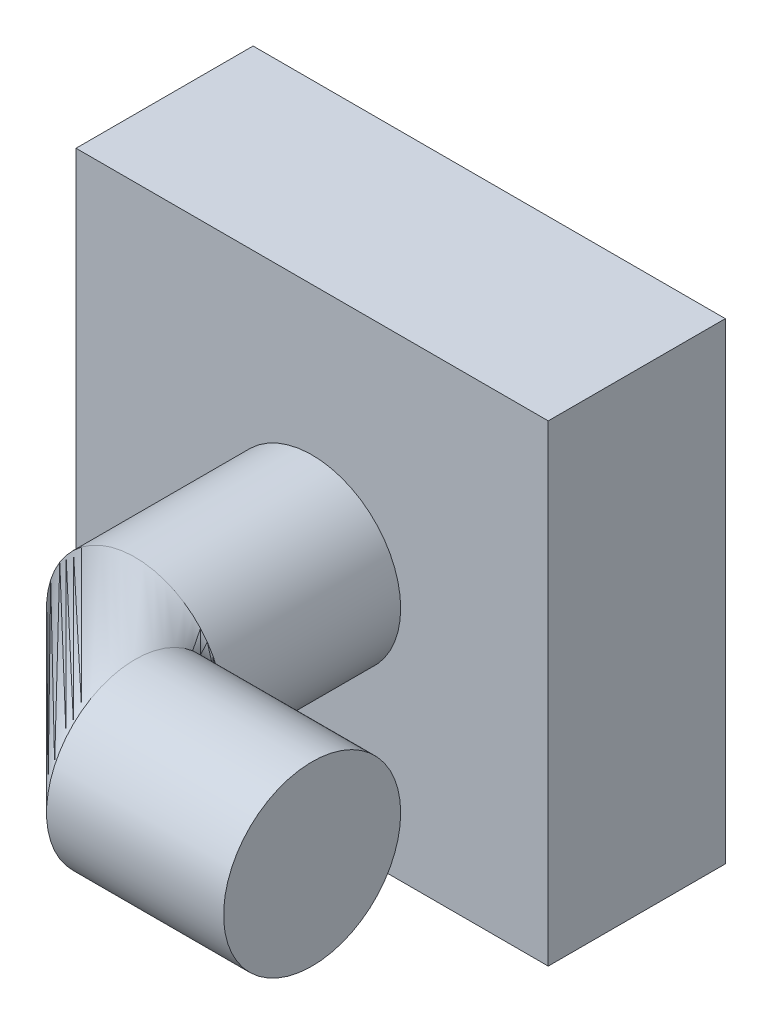
ISO-10303-21;
HEADER;
FILE_DESCRIPTION(('STEP AP214'),'2;1');
FILE_NAME('part.step','',(''),(''),'','','');
FILE_SCHEMA(('AUTOMOTIVE_DESIGN { 1 0 10303 214 1 1 1 1 }'));
ENDSEC;
DATA;
#1=APPLICATION_CONTEXT('core data for automotive mechanical design processes');
#2=APPLICATION_PROTOCOL_DEFINITION('international standard','automotive_design',2000,#1);
#3=PRODUCT_CONTEXT('',#1,'mechanical');
#4=PRODUCT('Part','Part','',(#3));
#5=PRODUCT_RELATED_PRODUCT_CATEGORY('part','',(#4));
#6=PRODUCT_DEFINITION_FORMATION('','',#4);
#7=PRODUCT_DEFINITION_CONTEXT('part definition',#1,'design');
#8=PRODUCT_DEFINITION('design','',#6,#7);
#9=PRODUCT_DEFINITION_SHAPE('','',#8);
#10=(LENGTH_UNIT() NAMED_UNIT(*) SI_UNIT(.MILLI.,.METRE.));
#11=(NAMED_UNIT(*) PLANE_ANGLE_UNIT() SI_UNIT($,.RADIAN.));
#12=(NAMED_UNIT(*) SI_UNIT($,.STERADIAN.) SOLID_ANGLE_UNIT());
#13=UNCERTAINTY_MEASURE_WITH_UNIT(LENGTH_MEASURE(1.E-05),#10,'distance_accuracy_value','');
#14=(GEOMETRIC_REPRESENTATION_CONTEXT(3) GLOBAL_UNCERTAINTY_ASSIGNED_CONTEXT((#13)) GLOBAL_UNIT_ASSIGNED_CONTEXT((#10,
#11,#12)) REPRESENTATION_CONTEXT('',''));
#15=CARTESIAN_POINT('',(0.,0.,0.));
#16=DIRECTION('',(0.,0.,1.));
#17=DIRECTION('',(1.,0.,0.));
#18=AXIS2_PLACEMENT_3D('',#15,#16,#17);
#19=CARTESIAN_POINT('',(57.15,0.,0.));
#20=DIRECTION('',(1.,0.,0.));
#21=DIRECTION('',(0.,0.,-1.));
#22=AXIS2_PLACEMENT_3D('',#19,#20,#21);
#23=PLANE('',#22);
#24=CARTESIAN_POINT('',(57.15,0.,0.));
#25=DIRECTION('',(1.,0.,0.));
#26=DIRECTION('',(0.,0.,-1.));
#27=AXIS2_PLACEMENT_3D('',#24,#25,#26);
#28=CIRCLE('',#27,19.05);
#29=CARTESIAN_POINT('',(57.15,0.,-19.05));
#30=VERTEX_POINT('',#29);
#31=EDGE_CURVE('E133',#30,#30,#28,.T.);
#32=ORIENTED_EDGE('',*,*,#31,.T.);
#33=EDGE_LOOP('',(#32));
#34=FACE_BOUND('',#33,.T.);
#35=ADVANCED_FACE('F39',(#34),#23,.T.);
#36=CARTESIAN_POINT('',(57.15,0.,0.));
#37=DIRECTION('',(-1.,0.,0.));
#38=DIRECTION('',(0.,0.,1.));
#39=AXIS2_PLACEMENT_3D('',#36,#37,#38);
#40=CYLINDRICAL_SURFACE('',#39,19.05);
#41=CARTESIAN_POINT('',(19.05,0.,0.));
#42=DIRECTION('',(1.,0.,0.));
#43=DIRECTION('',(0.,0.,-1.));
#44=AXIS2_PLACEMENT_3D('',#41,#42,#43);
#45=CIRCLE('',#44,19.05);
#46=CARTESIAN_POINT('',(19.05,0.,-19.05));
#47=VERTEX_POINT('',#46);
#48=EDGE_CURVE('E48',#47,#47,#45,.T.);
#49=ORIENTED_EDGE('',*,*,#48,.T.);
#50=EDGE_LOOP('',(#49));
#51=FACE_BOUND('',#50,.T.);
#52=ORIENTED_EDGE('',*,*,#31,.F.);
#53=EDGE_LOOP('',(#52));
#54=FACE_BOUND('',#53,.T.);
#55=ADVANCED_FACE('F139',(#51,#54),#40,.T.);
#56=CARTESIAN_POINT('',(19.05,0.,-19.05));
#57=DIRECTION('',(0.,-1.,0.));
#58=DIRECTION('',(0.,0.,-1.));
#59=AXIS2_PLACEMENT_3D('',#56,#57,#58);
#60=TOROIDAL_SURFACE('',#59,19.05,19.05);
#61=CARTESIAN_POINT('',(0.,0.,-19.05));
#62=DIRECTION('',(0.,0.,1.));
#63=DIRECTION('',(1.,0.,0.));
#64=AXIS2_PLACEMENT_3D('',#61,#62,#63);
#65=CIRCLE('',#64,19.05);
#66=EDGE_CURVE('E11',#47,#47,#65,.T.);
#67=ORIENTED_EDGE('',*,*,#66,.T.);
#68=ORIENTED_EDGE('',*,*,#48,.F.);
#69=EDGE_LOOP('',(#67,#68));
#70=FACE_BOUND('',#69,.T.);
#71=ADVANCED_FACE('F142',(#70),#60,.T.);
#72=CARTESIAN_POINT('',(0.,0.,-19.05));
#73=DIRECTION('',(0.,0.,-1.));
#74=DIRECTION('',(-1.,0.,0.));
#75=AXIS2_PLACEMENT_3D('',#72,#73,#74);
#76=CYLINDRICAL_SURFACE('',#75,19.05);
#77=CARTESIAN_POINT('',(0.,0.,-57.15));
#78=DIRECTION('',(0.,0.,1.));
#79=DIRECTION('',(1.,0.,0.));
#80=AXIS2_PLACEMENT_3D('',#77,#78,#79);
#81=CIRCLE('',#80,19.05);
#82=CARTESIAN_POINT('',(19.05,0.,-57.15));
#83=VERTEX_POINT('',#82);
#84=EDGE_CURVE('E42',#83,#83,#81,.T.);
#85=ORIENTED_EDGE('',*,*,#84,.T.);
#86=EDGE_LOOP('',(#85));
#87=FACE_BOUND('',#86,.T.);
#88=ORIENTED_EDGE('',*,*,#66,.F.);
#89=EDGE_LOOP('',(#88));
#90=FACE_BOUND('',#89,.T.);
#91=ADVANCED_FACE('F144',(#87,#90),#76,.T.);
#92=CARTESIAN_POINT('',(50.8,50.8,-95.25));
#93=DIRECTION('',(-1.,0.,0.));
#94=DIRECTION('',(0.,-1.,0.));
#95=AXIS2_PLACEMENT_3D('',#92,#93,#94);
#96=PLANE('',#95);
#97=DIRECTION('',(0.,-1.,0.));
#98=VECTOR('',#97,1.);
#99=CARTESIAN_POINT('',(50.8,50.8,-57.15));
#100=LINE('',#99,#98);
#101=CARTESIAN_POINT('',(50.8,50.8,-57.15));
#102=VERTEX_POINT('',#101);
#103=CARTESIAN_POINT('',(50.8,-50.8,-57.15));
#104=VERTEX_POINT('',#103);
#105=EDGE_CURVE('E116',#102,#104,#100,.T.);
#106=ORIENTED_EDGE('',*,*,#105,.T.);
#107=DIRECTION('',(0.,0.,1.));
#108=VECTOR('',#107,1.);
#109=CARTESIAN_POINT('',(50.8,-50.8,-95.25));
#110=LINE('',#109,#108);
#111=CARTESIAN_POINT('',(50.8,-50.8,-95.25));
#112=VERTEX_POINT('',#111);
#113=EDGE_CURVE('E105',#112,#104,#110,.T.);
#114=ORIENTED_EDGE('',*,*,#113,.F.);
#115=DIRECTION('',(0.,-1.,0.));
#116=VECTOR('',#115,1.);
#117=CARTESIAN_POINT('',(50.8,50.8,-95.25));
#118=LINE('',#117,#116);
#119=CARTESIAN_POINT('',(50.8,50.8,-95.25));
#120=VERTEX_POINT('',#119);
#121=EDGE_CURVE('E94',#120,#112,#118,.T.);
#122=ORIENTED_EDGE('',*,*,#121,.F.);
#123=DIRECTION('',(0.,0.,1.));
#124=VECTOR('',#123,1.);
#125=CARTESIAN_POINT('',(50.8,50.8,-95.25));
#126=LINE('',#125,#124);
#127=EDGE_CURVE('E112',#120,#102,#126,.T.);
#128=ORIENTED_EDGE('',*,*,#127,.T.);
#129=EDGE_LOOP('',(#106,#114,#122,#128));
#130=FACE_BOUND('',#129,.T.);
#131=ADVANCED_FACE('F146',(#130),#96,.F.);
#132=CARTESIAN_POINT('',(-50.8,-50.8,-95.25));
#133=DIRECTION('',(0.,1.,0.));
#134=DIRECTION('',(-1.,0.,0.));
#135=AXIS2_PLACEMENT_3D('',#132,#133,#134);
#136=PLANE('',#135);
#137=DIRECTION('',(-1.,0.,0.));
#138=VECTOR('',#137,1.);
#139=CARTESIAN_POINT('',(-50.8,-50.8,-57.15));
#140=LINE('',#139,#138);
#141=CARTESIAN_POINT('',(-50.8,-50.8,-57.15));
#142=VERTEX_POINT('',#141);
#143=EDGE_CURVE('E101',#104,#142,#140,.T.);
#144=ORIENTED_EDGE('',*,*,#143,.T.);
#145=DIRECTION('',(0.,0.,1.));
#146=VECTOR('',#145,1.);
#147=CARTESIAN_POINT('',(-50.8,-50.8,-95.25));
#148=LINE('',#147,#146);
#149=CARTESIAN_POINT('',(-50.8,-50.8,-95.25));
#150=VERTEX_POINT('',#149);
#151=EDGE_CURVE('E99',#150,#142,#148,.T.);
#152=ORIENTED_EDGE('',*,*,#151,.F.);
#153=DIRECTION('',(-1.,0.,0.));
#154=VECTOR('',#153,1.);
#155=CARTESIAN_POINT('',(-50.8,-50.8,-95.25));
#156=LINE('',#155,#154);
#157=EDGE_CURVE('E88',#112,#150,#156,.T.);
#158=ORIENTED_EDGE('',*,*,#157,.F.);
#159=ORIENTED_EDGE('',*,*,#113,.T.);
#160=EDGE_LOOP('',(#144,#152,#158,#159));
#161=FACE_BOUND('',#160,.T.);
#162=ADVANCED_FACE('F100',(#161),#136,.F.);
#163=CARTESIAN_POINT('',(-50.8,50.8,-95.25));
#164=DIRECTION('',(1.,0.,0.));
#165=DIRECTION('',(0.,1.,0.));
#166=AXIS2_PLACEMENT_3D('',#163,#164,#165);
#167=PLANE('',#166);
#168=DIRECTION('',(0.,1.,0.));
#169=VECTOR('',#168,1.);
#170=CARTESIAN_POINT('',(-50.8,50.8,-57.15));
#171=LINE('',#170,#169);
#172=CARTESIAN_POINT('',(-50.8,50.8,-57.15));
#173=VERTEX_POINT('',#172);
#174=EDGE_CURVE('E122',#142,#173,#171,.T.);
#175=ORIENTED_EDGE('',*,*,#174,.T.);
#176=DIRECTION('',(0.,0.,1.));
#177=VECTOR('',#176,1.);
#178=CARTESIAN_POINT('',(-50.8,50.8,-95.25));
#179=LINE('',#178,#177);
#180=CARTESIAN_POINT('',(-50.8,50.8,-95.25));
#181=VERTEX_POINT('',#180);
#182=EDGE_CURVE('E106',#181,#173,#179,.T.);
#183=ORIENTED_EDGE('',*,*,#182,.F.);
#184=DIRECTION('',(0.,1.,0.));
#185=VECTOR('',#184,1.);
#186=CARTESIAN_POINT('',(-50.8,50.8,-95.25));
#187=LINE('',#186,#185);
#188=EDGE_CURVE('E91',#150,#181,#187,.T.);
#189=ORIENTED_EDGE('',*,*,#188,.F.);
#190=ORIENTED_EDGE('',*,*,#151,.T.);
#191=EDGE_LOOP('',(#175,#183,#189,#190));
#192=FACE_BOUND('',#191,.T.);
#193=ADVANCED_FACE('F108',(#192),#167,.F.);
#194=CARTESIAN_POINT('',(-50.8,50.8,-95.25));
#195=DIRECTION('',(0.,-1.,0.));
#196=DIRECTION('',(1.,0.,0.));
#197=AXIS2_PLACEMENT_3D('',#194,#195,#196);
#198=PLANE('',#197);
#199=DIRECTION('',(1.,0.,0.));
#200=VECTOR('',#199,1.);
#201=CARTESIAN_POINT('',(-50.8,50.8,-57.15));
#202=LINE('',#201,#200);
#203=EDGE_CURVE('E80',#173,#102,#202,.T.);
#204=ORIENTED_EDGE('',*,*,#203,.T.);
#205=ORIENTED_EDGE('',*,*,#127,.F.);
#206=DIRECTION('',(1.,0.,0.));
#207=VECTOR('',#206,1.);
#208=CARTESIAN_POINT('',(-50.8,50.8,-95.25));
#209=LINE('',#208,#207);
#210=EDGE_CURVE('E60',#181,#120,#209,.T.);
#211=ORIENTED_EDGE('',*,*,#210,.F.);
#212=ORIENTED_EDGE('',*,*,#182,.T.);
#213=EDGE_LOOP('',(#204,#205,#211,#212));
#214=FACE_BOUND('',#213,.T.);
#215=ADVANCED_FACE('F163',(#214),#198,.F.);
#216=CARTESIAN_POINT('',(0.,0.,-95.25));
#217=DIRECTION('',(0.,0.,1.));
#218=DIRECTION('',(1.,0.,0.));
#219=AXIS2_PLACEMENT_3D('',#216,#217,#218);
#220=PLANE('',#219);
#221=ORIENTED_EDGE('',*,*,#121,.T.);
#222=ORIENTED_EDGE('',*,*,#157,.T.);
#223=ORIENTED_EDGE('',*,*,#188,.T.);
#224=ORIENTED_EDGE('',*,*,#210,.T.);
#225=EDGE_LOOP('',(#221,#222,#223,#224));
#226=FACE_BOUND('',#225,.T.);
#227=ADVANCED_FACE('F89',(#226),#220,.F.);
#228=CARTESIAN_POINT('',(0.,0.,-57.15));
#229=DIRECTION('',(0.,0.,1.));
#230=DIRECTION('',(1.,0.,0.));
#231=AXIS2_PLACEMENT_3D('',#228,#229,#230);
#232=PLANE('',#231);
#233=ORIENTED_EDGE('',*,*,#84,.F.);
#234=EDGE_LOOP('',(#233));
#235=FACE_BOUND('',#234,.T.);
#236=ORIENTED_EDGE('',*,*,#105,.F.);
#237=ORIENTED_EDGE('',*,*,#203,.F.);
#238=ORIENTED_EDGE('',*,*,#174,.F.);
#239=ORIENTED_EDGE('',*,*,#143,.F.);
#240=EDGE_LOOP('',(#236,#237,#238,#239));
#241=FACE_BOUND('',#240,.T.);
#242=ADVANCED_FACE('F166',(#235,#241),#232,.T.);
#243=CLOSED_SHELL('',(#35,#55,#71,#91,#131,#162,#193,#215,#227,#242));
#244=MANIFOLD_SOLID_BREP('B2',#243);
#245=ADVANCED_BREP_SHAPE_REPRESENTATION('',(#18,#244),#14);
#246=SHAPE_DEFINITION_REPRESENTATION(#9,#245);
ENDSEC;
END-ISO-10303-21;
